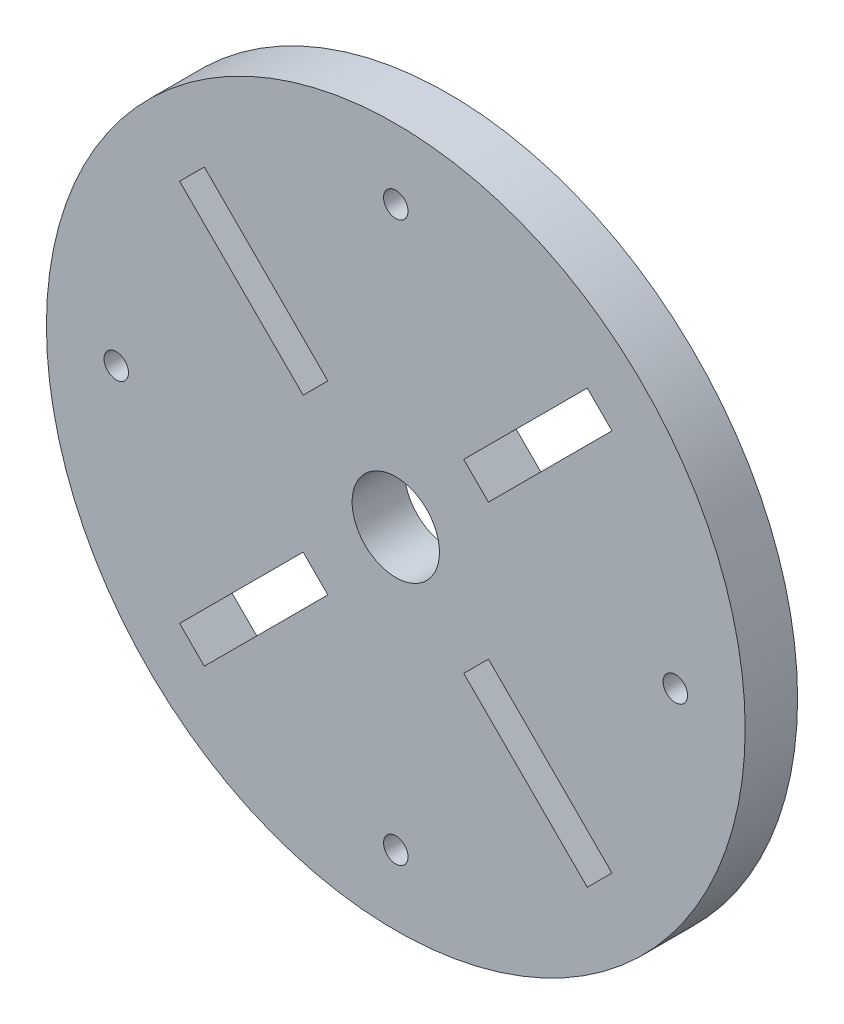
ISO-10303-21;
HEADER;
FILE_DESCRIPTION(('STEP AP214'),'2;1');
FILE_NAME('part.step','',(''),(''),'','','');
FILE_SCHEMA(('AUTOMOTIVE_DESIGN { 1 0 10303 214 1 1 1 1 }'));
ENDSEC;
DATA;
#1=APPLICATION_CONTEXT('core data for automotive mechanical design processes');
#2=APPLICATION_PROTOCOL_DEFINITION('international standard','automotive_design',2000,#1);
#3=PRODUCT_CONTEXT('',#1,'mechanical');
#4=PRODUCT('Part','Part','',(#3));
#5=PRODUCT_RELATED_PRODUCT_CATEGORY('part','',(#4));
#6=PRODUCT_DEFINITION_FORMATION('','',#4);
#7=PRODUCT_DEFINITION_CONTEXT('part definition',#1,'design');
#8=PRODUCT_DEFINITION('design','',#6,#7);
#9=PRODUCT_DEFINITION_SHAPE('','',#8);
#10=(LENGTH_UNIT() NAMED_UNIT(*) SI_UNIT(.MILLI.,.METRE.));
#11=(NAMED_UNIT(*) PLANE_ANGLE_UNIT() SI_UNIT($,.RADIAN.));
#12=(NAMED_UNIT(*) SI_UNIT($,.STERADIAN.) SOLID_ANGLE_UNIT());
#13=UNCERTAINTY_MEASURE_WITH_UNIT(LENGTH_MEASURE(1.E-05),#10,'distance_accuracy_value','');
#14=(GEOMETRIC_REPRESENTATION_CONTEXT(3) GLOBAL_UNCERTAINTY_ASSIGNED_CONTEXT((#13)) GLOBAL_UNIT_ASSIGNED_CONTEXT((#10,
#11,#12)) REPRESENTATION_CONTEXT('',''));
#15=CARTESIAN_POINT('',(0.,0.,0.));
#16=DIRECTION('',(0.,0.,1.));
#17=DIRECTION('',(1.,0.,0.));
#18=AXIS2_PLACEMENT_3D('',#15,#16,#17);
#19=CARTESIAN_POINT('',(0.,0.,3.));
#20=DIRECTION('',(0.,0.,-1.));
#21=DIRECTION('',(-1.,0.,0.));
#22=AXIS2_PLACEMENT_3D('',#19,#20,#21);
#23=CYLINDRICAL_SURFACE('',#22,20.);
#24=CARTESIAN_POINT('',(0.,0.,3.));
#25=DIRECTION('',(0.,0.,1.));
#26=DIRECTION('',(1.,0.,0.));
#27=AXIS2_PLACEMENT_3D('',#24,#25,#26);
#28=CIRCLE('',#27,20.);
#29=CARTESIAN_POINT('',(20.,0.,3.));
#30=VERTEX_POINT('',#29);
#31=EDGE_CURVE('E11',#30,#30,#28,.T.);
#32=ORIENTED_EDGE('',*,*,#31,.F.);
#33=EDGE_LOOP('',(#32));
#34=FACE_BOUND('',#33,.T.);
#35=CARTESIAN_POINT('',(0.,0.,0.));
#36=DIRECTION('',(0.,0.,1.));
#37=DIRECTION('',(1.,0.,0.));
#38=AXIS2_PLACEMENT_3D('',#35,#36,#37);
#39=CIRCLE('',#38,20.);
#40=CARTESIAN_POINT('',(20.,0.,0.));
#41=VERTEX_POINT('',#40);
#42=EDGE_CURVE('E36',#41,#41,#39,.T.);
#43=ORIENTED_EDGE('',*,*,#42,.T.);
#44=EDGE_LOOP('',(#43));
#45=FACE_BOUND('',#44,.T.);
#46=ADVANCED_FACE('F33',(#34,#45),#23,.T.);
#47=CARTESIAN_POINT('',(0.,0.,3.));
#48=DIRECTION('',(0.,0.,1.));
#49=DIRECTION('',(1.,0.,0.));
#50=AXIS2_PLACEMENT_3D('',#47,#48,#49);
#51=PLANE('',#50);
#52=DIRECTION('',(-0.70710678118655,-0.707106781186545,0.));
#53=VECTOR('',#52,1.);
#54=CARTESIAN_POINT('',(4.59619407771255,-4.59619407771246,3.));
#55=LINE('',#54,#53);
#56=CARTESIAN_POINT('',(5.3033008588991,-3.88908729652591,3.));
#57=VERTEX_POINT('',#56);
#58=CARTESIAN_POINT('',(3.889087296526,-5.303300858899,3.));
#59=VERTEX_POINT('',#58);
#60=EDGE_CURVE('E47',#57,#59,#55,.T.);
#61=ORIENTED_EDGE('',*,*,#60,.F.);
#62=DIRECTION('',(-0.707106781186545,0.70710678118655,0.));
#63=VECTOR('',#62,1.);
#64=CARTESIAN_POINT('',(5.3033008588991,-3.88908729652591,3.));
#65=LINE('',#64,#63);
#66=CARTESIAN_POINT('',(12.3743686707646,-10.9601551083914,3.));
#67=VERTEX_POINT('',#66);
#68=EDGE_CURVE('E177',#67,#57,#65,.T.);
#69=ORIENTED_EDGE('',*,*,#68,.F.);
#70=DIRECTION('',(0.70710678118655,0.707106781186545,0.));
#71=VECTOR('',#70,1.);
#72=CARTESIAN_POINT('',(12.3743686707646,-10.9601551083914,3.));
#73=LINE('',#72,#71);
#74=CARTESIAN_POINT('',(10.9601551083915,-12.3743686707645,3.));
#75=VERTEX_POINT('',#74);
#76=EDGE_CURVE('E169',#75,#67,#73,.T.);
#77=ORIENTED_EDGE('',*,*,#76,.F.);
#78=DIRECTION('',(0.707106781186545,-0.70710678118655,0.));
#79=VECTOR('',#78,1.);
#80=CARTESIAN_POINT('',(10.9601551083915,-12.3743686707645,3.));
#81=LINE('',#80,#79);
#82=EDGE_CURVE('E167',#59,#75,#81,.T.);
#83=ORIENTED_EDGE('',*,*,#82,.F.);
#84=EDGE_LOOP('',(#61,#69,#77,#83));
#85=FACE_BOUND('',#84,.T.);
#86=DIRECTION('',(-0.707106781186547,0.707106781186547,0.));
#87=VECTOR('',#86,1.);
#88=CARTESIAN_POINT('',(-4.59619407771244,-4.59619407771257,3.));
#89=LINE('',#88,#87);
#90=CARTESIAN_POINT('',(-3.88908729652589,-5.30330085889912,3.));
#91=VERTEX_POINT('',#90);
#92=CARTESIAN_POINT('',(-5.30330085889899,-3.88908729652602,3.));
#93=VERTEX_POINT('',#92);
#94=EDGE_CURVE('E55',#91,#93,#89,.T.);
#95=ORIENTED_EDGE('',*,*,#94,.F.);
#96=DIRECTION('',(0.707106781186548,0.707106781186547,0.));
#97=VECTOR('',#96,1.);
#98=CARTESIAN_POINT('',(-3.88908729652589,-5.30330085889912,3.));
#99=LINE('',#98,#97);
#100=CARTESIAN_POINT('',(-10.9601551083914,-12.3743686707646,3.));
#101=VERTEX_POINT('',#100);
#102=EDGE_CURVE('E200',#101,#91,#99,.T.);
#103=ORIENTED_EDGE('',*,*,#102,.F.);
#104=DIRECTION('',(0.707106781186547,-0.707106781186547,0.));
#105=VECTOR('',#104,1.);
#106=CARTESIAN_POINT('',(-10.9601551083914,-12.3743686707646,3.));
#107=LINE('',#106,#105);
#108=CARTESIAN_POINT('',(-12.3743686707645,-10.9601551083915,3.));
#109=VERTEX_POINT('',#108);
#110=EDGE_CURVE('E197',#109,#101,#107,.T.);
#111=ORIENTED_EDGE('',*,*,#110,.F.);
#112=DIRECTION('',(-0.707106781186547,-0.707106781186548,0.));
#113=VECTOR('',#112,1.);
#114=CARTESIAN_POINT('',(-12.3743686707645,-10.9601551083915,3.));
#115=LINE('',#114,#113);
#116=EDGE_CURVE('E194',#93,#109,#115,.T.);
#117=ORIENTED_EDGE('',*,*,#116,.F.);
#118=EDGE_LOOP('',(#95,#103,#111,#117));
#119=FACE_BOUND('',#118,.T.);
#120=DIRECTION('',(0.707106781186555,0.70710678118654,0.));
#121=VECTOR('',#120,1.);
#122=CARTESIAN_POINT('',(-4.59619407771252,4.59619407771249,3.));
#123=LINE('',#122,#121);
#124=CARTESIAN_POINT('',(-5.30330085889908,3.88908729652595,3.));
#125=VERTEX_POINT('',#124);
#126=CARTESIAN_POINT('',(-3.88908729652596,5.30330085889903,3.));
#127=VERTEX_POINT('',#126);
#128=EDGE_CURVE('E232',#125,#127,#123,.T.);
#129=ORIENTED_EDGE('',*,*,#128,.F.);
#130=DIRECTION('',(0.70710678118654,-0.707106781186555,0.));
#131=VECTOR('',#130,1.);
#132=CARTESIAN_POINT('',(-5.30330085889908,3.88908729652595,3.));
#133=LINE('',#132,#131);
#134=CARTESIAN_POINT('',(-12.3743686707645,10.9601551083915,3.));
#135=VERTEX_POINT('',#134);
#136=EDGE_CURVE('E229',#135,#125,#133,.T.);
#137=ORIENTED_EDGE('',*,*,#136,.F.);
#138=DIRECTION('',(-0.707106781186555,-0.70710678118654,0.));
#139=VECTOR('',#138,1.);
#140=CARTESIAN_POINT('',(-12.3743686707645,10.9601551083915,3.));
#141=LINE('',#140,#139);
#142=CARTESIAN_POINT('',(-10.9601551083914,12.3743686707646,3.));
#143=VERTEX_POINT('',#142);
#144=EDGE_CURVE('E226',#143,#135,#141,.T.);
#145=ORIENTED_EDGE('',*,*,#144,.F.);
#146=DIRECTION('',(-0.70710678118654,0.707106781186555,0.));
#147=VECTOR('',#146,1.);
#148=CARTESIAN_POINT('',(-10.9601551083914,12.3743686707646,3.));
#149=LINE('',#148,#147);
#150=EDGE_CURVE('E223',#127,#143,#149,.T.);
#151=ORIENTED_EDGE('',*,*,#150,.F.);
#152=EDGE_LOOP('',(#129,#137,#145,#151));
#153=FACE_BOUND('',#152,.T.);
#154=DIRECTION('',(0.707106781186547,-0.707106781186547,0.));
#155=VECTOR('',#154,1.);
#156=CARTESIAN_POINT('',(4.59619407771244,4.59619407771257,3.));
#157=LINE('',#156,#155);
#158=CARTESIAN_POINT('',(3.88908729652589,5.30330085889912,3.));
#159=VERTEX_POINT('',#158);
#160=CARTESIAN_POINT('',(5.30330085889899,3.88908729652602,3.));
#161=VERTEX_POINT('',#160);
#162=EDGE_CURVE('E261',#159,#161,#157,.T.);
#163=ORIENTED_EDGE('',*,*,#162,.F.);
#164=DIRECTION('',(-0.707106781186548,-0.707106781186547,0.));
#165=VECTOR('',#164,1.);
#166=CARTESIAN_POINT('',(3.88908729652589,5.30330085889912,3.));
#167=LINE('',#166,#165);
#168=CARTESIAN_POINT('',(10.9601551083914,12.3743686707646,3.));
#169=VERTEX_POINT('',#168);
#170=EDGE_CURVE('E258',#169,#159,#167,.T.);
#171=ORIENTED_EDGE('',*,*,#170,.F.);
#172=DIRECTION('',(-0.707106781186547,0.707106781186547,0.));
#173=VECTOR('',#172,1.);
#174=CARTESIAN_POINT('',(10.9601551083914,12.3743686707646,3.));
#175=LINE('',#174,#173);
#176=CARTESIAN_POINT('',(12.3743686707645,10.9601551083915,3.));
#177=VERTEX_POINT('',#176);
#178=EDGE_CURVE('E255',#177,#169,#175,.T.);
#179=ORIENTED_EDGE('',*,*,#178,.F.);
#180=DIRECTION('',(0.707106781186547,0.707106781186548,0.));
#181=VECTOR('',#180,1.);
#182=CARTESIAN_POINT('',(12.3743686707645,10.9601551083915,3.));
#183=LINE('',#182,#181);
#184=EDGE_CURVE('E252',#161,#177,#183,.T.);
#185=ORIENTED_EDGE('',*,*,#184,.F.);
#186=EDGE_LOOP('',(#163,#171,#179,#185));
#187=FACE_BOUND('',#186,.T.);
#188=CARTESIAN_POINT('',(0.,0.,3.));
#189=DIRECTION('',(0.,0.,1.));
#190=DIRECTION('',(1.,0.,0.));
#191=AXIS2_PLACEMENT_3D('',#188,#189,#190);
#192=CIRCLE('',#191,2.5);
#193=CARTESIAN_POINT('',(2.5,0.,3.));
#194=VERTEX_POINT('',#193);
#195=EDGE_CURVE('E275',#194,#194,#192,.T.);
#196=ORIENTED_EDGE('',*,*,#195,.F.);
#197=EDGE_LOOP('',(#196));
#198=FACE_BOUND('',#197,.T.);
#199=CARTESIAN_POINT('',(-16.,0.,3.));
#200=DIRECTION('',(0.,0.,1.));
#201=DIRECTION('',(0.,1.,0.));
#202=AXIS2_PLACEMENT_3D('',#199,#200,#201);
#203=CIRCLE('',#202,0.7);
#204=CARTESIAN_POINT('',(-16.,0.699999999999944,3.));
#205=VERTEX_POINT('',#204);
#206=EDGE_CURVE('E282',#205,#205,#203,.T.);
#207=ORIENTED_EDGE('',*,*,#206,.F.);
#208=EDGE_LOOP('',(#207));
#209=FACE_BOUND('',#208,.T.);
#210=CARTESIAN_POINT('',(0.,-16.,3.));
#211=DIRECTION('',(0.,0.,1.));
#212=DIRECTION('',(-1.,0.,0.));
#213=AXIS2_PLACEMENT_3D('',#210,#211,#212);
#214=CIRCLE('',#213,0.7);
#215=CARTESIAN_POINT('',(-0.7,-16.,3.));
#216=VERTEX_POINT('',#215);
#217=EDGE_CURVE('E290',#216,#216,#214,.T.);
#218=ORIENTED_EDGE('',*,*,#217,.F.);
#219=EDGE_LOOP('',(#218));
#220=FACE_BOUND('',#219,.T.);
#221=CARTESIAN_POINT('',(16.,1.6759110426447E-13,3.));
#222=DIRECTION('',(0.,0.,1.));
#223=DIRECTION('',(0.,-1.,0.));
#224=AXIS2_PLACEMENT_3D('',#221,#222,#223);
#225=CIRCLE('',#224,0.7);
#226=CARTESIAN_POINT('',(16.,-0.699999999999832,3.));
#227=VERTEX_POINT('',#226);
#228=EDGE_CURVE('E279',#227,#227,#225,.T.);
#229=ORIENTED_EDGE('',*,*,#228,.F.);
#230=EDGE_LOOP('',(#229));
#231=FACE_BOUND('',#230,.T.);
#232=CARTESIAN_POINT('',(0.,16.,3.));
#233=DIRECTION('',(0.,0.,1.));
#234=DIRECTION('',(1.,0.,0.));
#235=AXIS2_PLACEMENT_3D('',#232,#233,#234);
#236=CIRCLE('',#235,0.7);
#237=CARTESIAN_POINT('',(0.7,16.,3.));
#238=VERTEX_POINT('',#237);
#239=EDGE_CURVE('E289',#238,#238,#236,.T.);
#240=ORIENTED_EDGE('',*,*,#239,.F.);
#241=EDGE_LOOP('',(#240));
#242=FACE_BOUND('',#241,.T.);
#243=ORIENTED_EDGE('',*,*,#31,.T.);
#244=EDGE_LOOP('',(#243));
#245=FACE_BOUND('',#244,.T.);
#246=ADVANCED_FACE('F312',(#85,#119,#153,#187,#198,#209,#220,#231,#242,#245),#51,.T.);
#247=CARTESIAN_POINT('',(0.,0.,0.));
#248=DIRECTION('',(0.,0.,1.));
#249=DIRECTION('',(1.,0.,0.));
#250=AXIS2_PLACEMENT_3D('',#247,#248,#249);
#251=PLANE('',#250);
#252=DIRECTION('',(0.707106781186545,-0.70710678118655,0.));
#253=VECTOR('',#252,1.);
#254=CARTESIAN_POINT('',(5.3033008588991,-3.88908729652591,0.));
#255=LINE('',#254,#253);
#256=CARTESIAN_POINT('',(5.3033008588991,-3.88908729652591,0.));
#257=VERTEX_POINT('',#256);
#258=CARTESIAN_POINT('',(12.3743686707646,-10.9601551083914,0.));
#259=VERTEX_POINT('',#258);
#260=EDGE_CURVE('E166',#257,#259,#255,.T.);
#261=ORIENTED_EDGE('',*,*,#260,.F.);
#262=DIRECTION('',(0.70710678118655,0.707106781186545,0.));
#263=VECTOR('',#262,1.);
#264=CARTESIAN_POINT('',(4.59619407771255,-4.59619407771246,0.));
#265=LINE('',#264,#263);
#266=CARTESIAN_POINT('',(3.889087296526,-5.303300858899,0.));
#267=VERTEX_POINT('',#266);
#268=EDGE_CURVE('E147',#267,#257,#265,.T.);
#269=ORIENTED_EDGE('',*,*,#268,.F.);
#270=DIRECTION('',(-0.707106781186545,0.70710678118655,0.));
#271=VECTOR('',#270,1.);
#272=CARTESIAN_POINT('',(10.9601551083915,-12.3743686707645,0.));
#273=LINE('',#272,#271);
#274=CARTESIAN_POINT('',(10.9601551083915,-12.3743686707645,0.));
#275=VERTEX_POINT('',#274);
#276=EDGE_CURVE('E156',#275,#267,#273,.T.);
#277=ORIENTED_EDGE('',*,*,#276,.F.);
#278=DIRECTION('',(-0.70710678118655,-0.707106781186545,0.));
#279=VECTOR('',#278,1.);
#280=CARTESIAN_POINT('',(12.3743686707646,-10.9601551083914,0.));
#281=LINE('',#280,#279);
#282=EDGE_CURVE('E171',#259,#275,#281,.T.);
#283=ORIENTED_EDGE('',*,*,#282,.F.);
#284=EDGE_LOOP('',(#261,#269,#277,#283));
#285=FACE_BOUND('',#284,.T.);
#286=DIRECTION('',(-0.707106781186548,-0.707106781186547,0.));
#287=VECTOR('',#286,1.);
#288=CARTESIAN_POINT('',(-3.88908729652589,-5.30330085889912,0.));
#289=LINE('',#288,#287);
#290=CARTESIAN_POINT('',(-3.88908729652589,-5.30330085889912,0.));
#291=VERTEX_POINT('',#290);
#292=CARTESIAN_POINT('',(-10.9601551083914,-12.3743686707646,0.));
#293=VERTEX_POINT('',#292);
#294=EDGE_CURVE('E187',#291,#293,#289,.T.);
#295=ORIENTED_EDGE('',*,*,#294,.F.);
#296=DIRECTION('',(0.707106781186548,-0.707106781186548,0.));
#297=VECTOR('',#296,1.);
#298=CARTESIAN_POINT('',(-4.59619407771244,-4.59619407771257,0.));
#299=LINE('',#298,#297);
#300=CARTESIAN_POINT('',(-5.30330085889899,-3.88908729652602,0.));
#301=VERTEX_POINT('',#300);
#302=EDGE_CURVE('E191',#301,#291,#299,.T.);
#303=ORIENTED_EDGE('',*,*,#302,.F.);
#304=DIRECTION('',(0.707106781186547,0.707106781186548,0.));
#305=VECTOR('',#304,1.);
#306=CARTESIAN_POINT('',(-12.3743686707645,-10.9601551083915,0.));
#307=LINE('',#306,#305);
#308=CARTESIAN_POINT('',(-12.3743686707645,-10.9601551083915,0.));
#309=VERTEX_POINT('',#308);
#310=EDGE_CURVE('E207',#309,#301,#307,.T.);
#311=ORIENTED_EDGE('',*,*,#310,.F.);
#312=DIRECTION('',(-0.707106781186548,0.707106781186548,0.));
#313=VECTOR('',#312,1.);
#314=CARTESIAN_POINT('',(-10.9601551083914,-12.3743686707646,0.));
#315=LINE('',#314,#313);
#316=EDGE_CURVE('E185',#293,#309,#315,.T.);
#317=ORIENTED_EDGE('',*,*,#316,.F.);
#318=EDGE_LOOP('',(#295,#303,#311,#317));
#319=FACE_BOUND('',#318,.T.);
#320=DIRECTION('',(-0.70710678118654,0.707106781186555,0.));
#321=VECTOR('',#320,1.);
#322=CARTESIAN_POINT('',(-5.30330085889908,3.88908729652595,0.));
#323=LINE('',#322,#321);
#324=CARTESIAN_POINT('',(-5.30330085889908,3.88908729652595,0.));
#325=VERTEX_POINT('',#324);
#326=CARTESIAN_POINT('',(-12.3743686707645,10.9601551083915,0.));
#327=VERTEX_POINT('',#326);
#328=EDGE_CURVE('E217',#325,#327,#323,.T.);
#329=ORIENTED_EDGE('',*,*,#328,.F.);
#330=DIRECTION('',(-0.707106781186555,-0.70710678118654,0.));
#331=VECTOR('',#330,1.);
#332=CARTESIAN_POINT('',(-4.59619407771252,4.59619407771249,0.));
#333=LINE('',#332,#331);
#334=CARTESIAN_POINT('',(-3.88908729652597,5.30330085889903,0.));
#335=VERTEX_POINT('',#334);
#336=EDGE_CURVE('E220',#335,#325,#333,.T.);
#337=ORIENTED_EDGE('',*,*,#336,.F.);
#338=DIRECTION('',(0.70710678118654,-0.707106781186555,0.));
#339=VECTOR('',#338,1.);
#340=CARTESIAN_POINT('',(-10.9601551083914,12.3743686707646,0.));
#341=LINE('',#340,#339);
#342=CARTESIAN_POINT('',(-10.9601551083914,12.3743686707646,0.));
#343=VERTEX_POINT('',#342);
#344=EDGE_CURVE('E188',#343,#335,#341,.T.);
#345=ORIENTED_EDGE('',*,*,#344,.F.);
#346=DIRECTION('',(0.707106781186555,0.70710678118654,0.));
#347=VECTOR('',#346,1.);
#348=CARTESIAN_POINT('',(-12.3743686707645,10.9601551083915,0.));
#349=LINE('',#348,#347);
#350=EDGE_CURVE('E215',#327,#343,#349,.T.);
#351=ORIENTED_EDGE('',*,*,#350,.F.);
#352=EDGE_LOOP('',(#329,#337,#345,#351));
#353=FACE_BOUND('',#352,.T.);
#354=DIRECTION('',(0.707106781186548,0.707106781186547,0.));
#355=VECTOR('',#354,1.);
#356=CARTESIAN_POINT('',(3.88908729652589,5.30330085889912,0.));
#357=LINE('',#356,#355);
#358=CARTESIAN_POINT('',(3.88908729652589,5.30330085889912,0.));
#359=VERTEX_POINT('',#358);
#360=CARTESIAN_POINT('',(10.9601551083914,12.3743686707646,0.));
#361=VERTEX_POINT('',#360);
#362=EDGE_CURVE('E246',#359,#361,#357,.T.);
#363=ORIENTED_EDGE('',*,*,#362,.F.);
#364=DIRECTION('',(-0.707106781186548,0.707106781186548,0.));
#365=VECTOR('',#364,1.);
#366=CARTESIAN_POINT('',(4.59619407771244,4.59619407771257,0.));
#367=LINE('',#366,#365);
#368=CARTESIAN_POINT('',(5.30330085889899,3.88908729652602,0.));
#369=VERTEX_POINT('',#368);
#370=EDGE_CURVE('E249',#369,#359,#367,.T.);
#371=ORIENTED_EDGE('',*,*,#370,.F.);
#372=DIRECTION('',(-0.707106781186547,-0.707106781186548,0.));
#373=VECTOR('',#372,1.);
#374=CARTESIAN_POINT('',(12.3743686707645,10.9601551083915,0.));
#375=LINE('',#374,#373);
#376=CARTESIAN_POINT('',(12.3743686707645,10.9601551083915,0.));
#377=VERTEX_POINT('',#376);
#378=EDGE_CURVE('E266',#377,#369,#375,.T.);
#379=ORIENTED_EDGE('',*,*,#378,.F.);
#380=DIRECTION('',(0.707106781186548,-0.707106781186548,0.));
#381=VECTOR('',#380,1.);
#382=CARTESIAN_POINT('',(10.9601551083914,12.3743686707646,0.));
#383=LINE('',#382,#381);
#384=EDGE_CURVE('E160',#361,#377,#383,.T.);
#385=ORIENTED_EDGE('',*,*,#384,.F.);
#386=EDGE_LOOP('',(#363,#371,#379,#385));
#387=FACE_BOUND('',#386,.T.);
#388=CARTESIAN_POINT('',(0.,0.,0.));
#389=DIRECTION('',(0.,0.,1.));
#390=DIRECTION('',(1.,0.,0.));
#391=AXIS2_PLACEMENT_3D('',#388,#389,#390);
#392=CIRCLE('',#391,2.5);
#393=CARTESIAN_POINT('',(2.5,0.,0.));
#394=VERTEX_POINT('',#393);
#395=EDGE_CURVE('E276',#394,#394,#392,.T.);
#396=ORIENTED_EDGE('',*,*,#395,.T.);
#397=EDGE_LOOP('',(#396));
#398=FACE_BOUND('',#397,.T.);
#399=CARTESIAN_POINT('',(-16.,0.,0.));
#400=DIRECTION('',(0.,0.,1.));
#401=DIRECTION('',(1.,0.,0.));
#402=AXIS2_PLACEMENT_3D('',#399,#400,#401);
#403=CIRCLE('',#402,0.7);
#404=CARTESIAN_POINT('',(-15.3,0.,0.));
#405=VERTEX_POINT('',#404);
#406=EDGE_CURVE('E285',#405,#405,#403,.F.);
#407=ORIENTED_EDGE('',*,*,#406,.F.);
#408=EDGE_LOOP('',(#407));
#409=FACE_BOUND('',#408,.T.);
#410=CARTESIAN_POINT('',(0.,-16.,0.));
#411=DIRECTION('',(0.,0.,1.));
#412=DIRECTION('',(1.,0.,0.));
#413=AXIS2_PLACEMENT_3D('',#410,#411,#412);
#414=CIRCLE('',#413,0.7);
#415=CARTESIAN_POINT('',(0.7,-16.,0.));
#416=VERTEX_POINT('',#415);
#417=EDGE_CURVE('E286',#416,#416,#414,.F.);
#418=ORIENTED_EDGE('',*,*,#417,.F.);
#419=EDGE_LOOP('',(#418));
#420=FACE_BOUND('',#419,.T.);
#421=CARTESIAN_POINT('',(16.,1.6759110426447E-13,0.));
#422=DIRECTION('',(0.,0.,1.));
#423=DIRECTION('',(1.,0.,0.));
#424=AXIS2_PLACEMENT_3D('',#421,#422,#423);
#425=CIRCLE('',#424,0.7);
#426=CARTESIAN_POINT('',(16.7,1.6759110426447E-13,0.));
#427=VERTEX_POINT('',#426);
#428=EDGE_CURVE('E293',#427,#427,#425,.F.);
#429=ORIENTED_EDGE('',*,*,#428,.F.);
#430=EDGE_LOOP('',(#429));
#431=FACE_BOUND('',#430,.T.);
#432=CARTESIAN_POINT('',(0.,16.,0.));
#433=DIRECTION('',(0.,0.,1.));
#434=DIRECTION('',(1.,0.,0.));
#435=AXIS2_PLACEMENT_3D('',#432,#433,#434);
#436=CIRCLE('',#435,0.7);
#437=CARTESIAN_POINT('',(0.7,16.,0.));
#438=VERTEX_POINT('',#437);
#439=EDGE_CURVE('E302',#438,#438,#436,.F.);
#440=ORIENTED_EDGE('',*,*,#439,.F.);
#441=EDGE_LOOP('',(#440));
#442=FACE_BOUND('',#441,.T.);
#443=ORIENTED_EDGE('',*,*,#42,.F.);
#444=EDGE_LOOP('',(#443));
#445=FACE_BOUND('',#444,.T.);
#446=ADVANCED_FACE('F163',(#285,#319,#353,#387,#398,#409,#420,#431,#442,#445),#251,.F.);
#447=CARTESIAN_POINT('',(0.,16.,-0.00100000000000013));
#448=DIRECTION('',(0.,0.,1.));
#449=DIRECTION('',(1.,0.,0.));
#450=AXIS2_PLACEMENT_3D('',#447,#448,#449);
#451=CYLINDRICAL_SURFACE('',#450,0.7);
#452=ORIENTED_EDGE('',*,*,#239,.T.);
#453=EDGE_LOOP('',(#452));
#454=FACE_BOUND('',#453,.T.);
#455=ORIENTED_EDGE('',*,*,#439,.T.);
#456=EDGE_LOOP('',(#455));
#457=FACE_BOUND('',#456,.T.);
#458=ADVANCED_FACE('F311',(#454,#457),#451,.F.);
#459=CARTESIAN_POINT('',(16.,1.6759110426447E-13,-0.00100000000000013));
#460=DIRECTION('',(0.,0.,1.));
#461=DIRECTION('',(1.,0.,0.));
#462=AXIS2_PLACEMENT_3D('',#459,#460,#461);
#463=CYLINDRICAL_SURFACE('',#462,0.7);
#464=ORIENTED_EDGE('',*,*,#228,.T.);
#465=EDGE_LOOP('',(#464));
#466=FACE_BOUND('',#465,.T.);
#467=ORIENTED_EDGE('',*,*,#428,.T.);
#468=EDGE_LOOP('',(#467));
#469=FACE_BOUND('',#468,.T.);
#470=ADVANCED_FACE('F317',(#466,#469),#463,.F.);
#471=CARTESIAN_POINT('',(0.,-16.,-0.00100000000000013));
#472=DIRECTION('',(0.,0.,1.));
#473=DIRECTION('',(1.,0.,0.));
#474=AXIS2_PLACEMENT_3D('',#471,#472,#473);
#475=CYLINDRICAL_SURFACE('',#474,0.7);
#476=ORIENTED_EDGE('',*,*,#217,.T.);
#477=EDGE_LOOP('',(#476));
#478=FACE_BOUND('',#477,.T.);
#479=ORIENTED_EDGE('',*,*,#417,.T.);
#480=EDGE_LOOP('',(#479));
#481=FACE_BOUND('',#480,.T.);
#482=ADVANCED_FACE('F488',(#478,#481),#475,.F.);
#483=CARTESIAN_POINT('',(-16.,0.,-0.00100000000000013));
#484=DIRECTION('',(0.,0.,1.));
#485=DIRECTION('',(1.,0.,0.));
#486=AXIS2_PLACEMENT_3D('',#483,#484,#485);
#487=CYLINDRICAL_SURFACE('',#486,0.7);
#488=ORIENTED_EDGE('',*,*,#206,.T.);
#489=EDGE_LOOP('',(#488));
#490=FACE_BOUND('',#489,.T.);
#491=ORIENTED_EDGE('',*,*,#406,.T.);
#492=EDGE_LOOP('',(#491));
#493=FACE_BOUND('',#492,.T.);
#494=ADVANCED_FACE('F484',(#490,#493),#487,.F.);
#495=CARTESIAN_POINT('',(0.,0.,0.));
#496=DIRECTION('',(0.,0.,1.));
#497=DIRECTION('',(1.,0.,0.));
#498=AXIS2_PLACEMENT_3D('',#495,#496,#497);
#499=CYLINDRICAL_SURFACE('',#498,2.5);
#500=ORIENTED_EDGE('',*,*,#395,.F.);
#501=EDGE_LOOP('',(#500));
#502=FACE_BOUND('',#501,.T.);
#503=ORIENTED_EDGE('',*,*,#195,.T.);
#504=EDGE_LOOP('',(#503));
#505=FACE_BOUND('',#504,.T.);
#506=ADVANCED_FACE('F471',(#502,#505),#499,.F.);
#507=CARTESIAN_POINT('',(4.59619407771244,4.59619407771257,-0.00100000000000013));
#508=DIRECTION('',(-0.707106781186547,-0.707106781186547,0.));
#509=DIRECTION('',(0.707106781186548,-0.707106781186548,0.));
#510=AXIS2_PLACEMENT_3D('',#507,#508,#509);
#511=PLANE('',#510);
#512=ORIENTED_EDGE('',*,*,#370,.T.);
#513=DIRECTION('',(0.,0.,1.));
#514=VECTOR('',#513,1.);
#515=CARTESIAN_POINT('',(3.88908729652589,5.30330085889912,-0.00100000000000013));
#516=LINE('',#515,#514);
#517=EDGE_CURVE('E264',#359,#159,#516,.T.);
#518=ORIENTED_EDGE('',*,*,#517,.T.);
#519=ORIENTED_EDGE('',*,*,#162,.T.);
#520=DIRECTION('',(0.,0.,1.));
#521=VECTOR('',#520,1.);
#522=CARTESIAN_POINT('',(5.30330085889899,3.88908729652602,-0.00100000000000013));
#523=LINE('',#522,#521);
#524=EDGE_CURVE('E263',#369,#161,#523,.T.);
#525=ORIENTED_EDGE('',*,*,#524,.F.);
#526=EDGE_LOOP('',(#512,#518,#519,#525));
#527=FACE_BOUND('',#526,.T.);
#528=ADVANCED_FACE('F467',(#527),#511,.F.);
#529=CARTESIAN_POINT('',(3.88908729652589,5.30330085889912,-0.00100000000000013));
#530=DIRECTION('',(-0.707106781186547,0.707106781186548,0.));
#531=DIRECTION('',(-0.707106781186548,-0.707106781186547,0.));
#532=AXIS2_PLACEMENT_3D('',#529,#530,#531);
#533=PLANE('',#532);
#534=ORIENTED_EDGE('',*,*,#362,.T.);
#535=DIRECTION('',(0.,0.,1.));
#536=VECTOR('',#535,1.);
#537=CARTESIAN_POINT('',(10.9601551083914,12.3743686707646,-0.00100000000000013));
#538=LINE('',#537,#536);
#539=EDGE_CURVE('E267',#361,#169,#538,.T.);
#540=ORIENTED_EDGE('',*,*,#539,.T.);
#541=ORIENTED_EDGE('',*,*,#170,.T.);
#542=ORIENTED_EDGE('',*,*,#517,.F.);
#543=EDGE_LOOP('',(#534,#540,#541,#542));
#544=FACE_BOUND('',#543,.T.);
#545=ADVANCED_FACE('F470',(#544),#533,.F.);
#546=CARTESIAN_POINT('',(10.9601551083914,12.3743686707646,-0.00100000000000013));
#547=DIRECTION('',(0.707106781186547,0.707106781186547,0.));
#548=DIRECTION('',(-0.707106781186548,0.707106781186548,0.));
#549=AXIS2_PLACEMENT_3D('',#546,#547,#548);
#550=PLANE('',#549);
#551=ORIENTED_EDGE('',*,*,#384,.T.);
#552=DIRECTION('',(0.,0.,1.));
#553=VECTOR('',#552,1.);
#554=CARTESIAN_POINT('',(12.3743686707645,10.9601551083915,-0.00100000000000013));
#555=LINE('',#554,#553);
#556=EDGE_CURVE('E269',#377,#177,#555,.T.);
#557=ORIENTED_EDGE('',*,*,#556,.T.);
#558=ORIENTED_EDGE('',*,*,#178,.T.);
#559=ORIENTED_EDGE('',*,*,#539,.F.);
#560=EDGE_LOOP('',(#551,#557,#558,#559));
#561=FACE_BOUND('',#560,.T.);
#562=ADVANCED_FACE('F475',(#561),#550,.F.);
#563=CARTESIAN_POINT('',(12.3743686707645,10.9601551083915,-0.00100000000000013));
#564=DIRECTION('',(0.707106781186548,-0.707106781186547,0.));
#565=DIRECTION('',(0.707106781186547,0.707106781186548,0.));
#566=AXIS2_PLACEMENT_3D('',#563,#564,#565);
#567=PLANE('',#566);
#568=ORIENTED_EDGE('',*,*,#378,.T.);
#569=ORIENTED_EDGE('',*,*,#524,.T.);
#570=ORIENTED_EDGE('',*,*,#184,.T.);
#571=ORIENTED_EDGE('',*,*,#556,.F.);
#572=EDGE_LOOP('',(#568,#569,#570,#571));
#573=FACE_BOUND('',#572,.T.);
#574=ADVANCED_FACE('F339',(#573),#567,.F.);
#575=CARTESIAN_POINT('',(-4.59619407771252,4.59619407771249,-0.00100000000000013));
#576=DIRECTION('',(0.70710678118654,-0.707106781186555,0.));
#577=DIRECTION('',(0.707106781186555,0.70710678118654,0.));
#578=AXIS2_PLACEMENT_3D('',#575,#576,#577);
#579=PLANE('',#578);
#580=ORIENTED_EDGE('',*,*,#336,.T.);
#581=DIRECTION('',(0.,0.,1.));
#582=VECTOR('',#581,1.);
#583=CARTESIAN_POINT('',(-5.30330085889908,3.88908729652595,-0.00100000000000013));
#584=LINE('',#583,#582);
#585=EDGE_CURVE('E235',#325,#125,#584,.T.);
#586=ORIENTED_EDGE('',*,*,#585,.T.);
#587=ORIENTED_EDGE('',*,*,#128,.T.);
#588=DIRECTION('',(0.,0.,1.));
#589=VECTOR('',#588,1.);
#590=CARTESIAN_POINT('',(-3.88908729652596,5.30330085889903,-0.00100000000000013));
#591=LINE('',#590,#589);
#592=EDGE_CURVE('E234',#335,#127,#591,.T.);
#593=ORIENTED_EDGE('',*,*,#592,.F.);
#594=EDGE_LOOP('',(#580,#586,#587,#593));
#595=FACE_BOUND('',#594,.T.);
#596=ADVANCED_FACE('F349',(#595),#579,.F.);
#597=CARTESIAN_POINT('',(-5.30330085889908,3.88908729652595,-0.00100000000000013));
#598=DIRECTION('',(-0.707106781186555,-0.70710678118654,0.));
#599=DIRECTION('',(0.70710678118654,-0.707106781186555,0.));
#600=AXIS2_PLACEMENT_3D('',#597,#598,#599);
#601=PLANE('',#600);
#602=ORIENTED_EDGE('',*,*,#328,.T.);
#603=DIRECTION('',(0.,0.,1.));
#604=VECTOR('',#603,1.);
#605=CARTESIAN_POINT('',(-12.3743686707645,10.9601551083915,-0.00100000000000013));
#606=LINE('',#605,#604);
#607=EDGE_CURVE('E237',#327,#135,#606,.T.);
#608=ORIENTED_EDGE('',*,*,#607,.T.);
#609=ORIENTED_EDGE('',*,*,#136,.T.);
#610=ORIENTED_EDGE('',*,*,#585,.F.);
#611=EDGE_LOOP('',(#602,#608,#609,#610));
#612=FACE_BOUND('',#611,.T.);
#613=ADVANCED_FACE('F354',(#612),#601,.F.);
#614=CARTESIAN_POINT('',(-12.3743686707645,10.9601551083915,-0.00100000000000013));
#615=DIRECTION('',(-0.70710678118654,0.707106781186555,0.));
#616=DIRECTION('',(-0.707106781186555,-0.70710678118654,0.));
#617=AXIS2_PLACEMENT_3D('',#614,#615,#616);
#618=PLANE('',#617);
#619=ORIENTED_EDGE('',*,*,#350,.T.);
#620=DIRECTION('',(0.,0.,1.));
#621=VECTOR('',#620,1.);
#622=CARTESIAN_POINT('',(-10.9601551083914,12.3743686707646,-0.00100000000000013));
#623=LINE('',#622,#621);
#624=EDGE_CURVE('E239',#343,#143,#623,.T.);
#625=ORIENTED_EDGE('',*,*,#624,.T.);
#626=ORIENTED_EDGE('',*,*,#144,.T.);
#627=ORIENTED_EDGE('',*,*,#607,.F.);
#628=EDGE_LOOP('',(#619,#625,#626,#627));
#629=FACE_BOUND('',#628,.T.);
#630=ADVANCED_FACE('F365',(#629),#618,.F.);
#631=CARTESIAN_POINT('',(-10.9601551083914,12.3743686707646,-0.00100000000000013));
#632=DIRECTION('',(0.707106781186555,0.70710678118654,0.));
#633=DIRECTION('',(-0.70710678118654,0.707106781186555,0.));
#634=AXIS2_PLACEMENT_3D('',#631,#632,#633);
#635=PLANE('',#634);
#636=ORIENTED_EDGE('',*,*,#344,.T.);
#637=ORIENTED_EDGE('',*,*,#592,.T.);
#638=ORIENTED_EDGE('',*,*,#150,.T.);
#639=ORIENTED_EDGE('',*,*,#624,.F.);
#640=EDGE_LOOP('',(#636,#637,#638,#639));
#641=FACE_BOUND('',#640,.T.);
#642=ADVANCED_FACE('F375',(#641),#635,.F.);
#643=CARTESIAN_POINT('',(-4.59619407771244,-4.59619407771257,-0.00100000000000013));
#644=DIRECTION('',(0.707106781186547,0.707106781186547,0.));
#645=DIRECTION('',(-0.707106781186548,0.707106781186548,0.));
#646=AXIS2_PLACEMENT_3D('',#643,#644,#645);
#647=PLANE('',#646);
#648=ORIENTED_EDGE('',*,*,#302,.T.);
#649=DIRECTION('',(0.,0.,1.));
#650=VECTOR('',#649,1.);
#651=CARTESIAN_POINT('',(-3.88908729652589,-5.30330085889912,-0.00100000000000013));
#652=LINE('',#651,#650);
#653=EDGE_CURVE('E205',#291,#91,#652,.T.);
#654=ORIENTED_EDGE('',*,*,#653,.T.);
#655=ORIENTED_EDGE('',*,*,#94,.T.);
#656=DIRECTION('',(0.,0.,1.));
#657=VECTOR('',#656,1.);
#658=CARTESIAN_POINT('',(-5.30330085889899,-3.88908729652602,-0.00100000000000013));
#659=LINE('',#658,#657);
#660=EDGE_CURVE('E204',#301,#93,#659,.T.);
#661=ORIENTED_EDGE('',*,*,#660,.F.);
#662=EDGE_LOOP('',(#648,#654,#655,#661));
#663=FACE_BOUND('',#662,.T.);
#664=ADVANCED_FACE('F385',(#663),#647,.F.);
#665=CARTESIAN_POINT('',(-3.88908729652589,-5.30330085889912,-0.00100000000000013));
#666=DIRECTION('',(0.707106781186547,-0.707106781186548,0.));
#667=DIRECTION('',(0.707106781186548,0.707106781186547,0.));
#668=AXIS2_PLACEMENT_3D('',#665,#666,#667);
#669=PLANE('',#668);
#670=ORIENTED_EDGE('',*,*,#294,.T.);
#671=DIRECTION('',(0.,0.,1.));
#672=VECTOR('',#671,1.);
#673=CARTESIAN_POINT('',(-10.9601551083914,-12.3743686707646,-0.00100000000000013));
#674=LINE('',#673,#672);
#675=EDGE_CURVE('E208',#293,#101,#674,.T.);
#676=ORIENTED_EDGE('',*,*,#675,.T.);
#677=ORIENTED_EDGE('',*,*,#102,.T.);
#678=ORIENTED_EDGE('',*,*,#653,.F.);
#679=EDGE_LOOP('',(#670,#676,#677,#678));
#680=FACE_BOUND('',#679,.T.);
#681=ADVANCED_FACE('F396',(#680),#669,.F.);
#682=CARTESIAN_POINT('',(-10.9601551083914,-12.3743686707646,-0.00100000000000013));
#683=DIRECTION('',(-0.707106781186547,-0.707106781186547,0.));
#684=DIRECTION('',(0.707106781186548,-0.707106781186548,0.));
#685=AXIS2_PLACEMENT_3D('',#682,#683,#684);
#686=PLANE('',#685);
#687=ORIENTED_EDGE('',*,*,#316,.T.);
#688=DIRECTION('',(0.,0.,1.));
#689=VECTOR('',#688,1.);
#690=CARTESIAN_POINT('',(-12.3743686707645,-10.9601551083915,-0.00100000000000013));
#691=LINE('',#690,#689);
#692=EDGE_CURVE('E210',#309,#109,#691,.T.);
#693=ORIENTED_EDGE('',*,*,#692,.T.);
#694=ORIENTED_EDGE('',*,*,#110,.T.);
#695=ORIENTED_EDGE('',*,*,#675,.F.);
#696=EDGE_LOOP('',(#687,#693,#694,#695));
#697=FACE_BOUND('',#696,.T.);
#698=ADVANCED_FACE('F405',(#697),#686,.F.);
#699=CARTESIAN_POINT('',(-12.3743686707645,-10.9601551083915,-0.00100000000000013));
#700=DIRECTION('',(-0.707106781186548,0.707106781186547,0.));
#701=DIRECTION('',(-0.707106781186547,-0.707106781186548,0.));
#702=AXIS2_PLACEMENT_3D('',#699,#700,#701);
#703=PLANE('',#702);
#704=ORIENTED_EDGE('',*,*,#310,.T.);
#705=ORIENTED_EDGE('',*,*,#660,.T.);
#706=ORIENTED_EDGE('',*,*,#116,.T.);
#707=ORIENTED_EDGE('',*,*,#692,.F.);
#708=EDGE_LOOP('',(#704,#705,#706,#707));
#709=FACE_BOUND('',#708,.T.);
#710=ADVANCED_FACE('F415',(#709),#703,.F.);
#711=CARTESIAN_POINT('',(4.59619407771255,-4.59619407771246,-0.00100000000000013));
#712=DIRECTION('',(-0.707106781186545,0.70710678118655,0.));
#713=DIRECTION('',(-0.70710678118655,-0.707106781186545,0.));
#714=AXIS2_PLACEMENT_3D('',#711,#712,#713);
#715=PLANE('',#714);
#716=ORIENTED_EDGE('',*,*,#268,.T.);
#717=DIRECTION('',(0.,0.,1.));
#718=VECTOR('',#717,1.);
#719=CARTESIAN_POINT('',(5.3033008588991,-3.88908729652591,-0.00100000000000013));
#720=LINE('',#719,#718);
#721=EDGE_CURVE('E161',#257,#57,#720,.T.);
#722=ORIENTED_EDGE('',*,*,#721,.T.);
#723=ORIENTED_EDGE('',*,*,#60,.T.);
#724=DIRECTION('',(0.,0.,1.));
#725=VECTOR('',#724,1.);
#726=CARTESIAN_POINT('',(3.889087296526,-5.303300858899,-0.00100000000000013));
#727=LINE('',#726,#725);
#728=EDGE_CURVE('E143',#267,#59,#727,.T.);
#729=ORIENTED_EDGE('',*,*,#728,.F.);
#730=EDGE_LOOP('',(#716,#722,#723,#729));
#731=FACE_BOUND('',#730,.T.);
#732=ADVANCED_FACE('F145',(#731),#715,.F.);
#733=CARTESIAN_POINT('',(5.3033008588991,-3.88908729652591,-0.00100000000000013));
#734=DIRECTION('',(0.70710678118655,0.707106781186545,0.));
#735=DIRECTION('',(-0.707106781186545,0.70710678118655,0.));
#736=AXIS2_PLACEMENT_3D('',#733,#734,#735);
#737=PLANE('',#736);
#738=ORIENTED_EDGE('',*,*,#260,.T.);
#739=DIRECTION('',(0.,0.,1.));
#740=VECTOR('',#739,1.);
#741=CARTESIAN_POINT('',(12.3743686707646,-10.9601551083914,-0.00100000000000013));
#742=LINE('',#741,#740);
#743=EDGE_CURVE('E182',#259,#67,#742,.T.);
#744=ORIENTED_EDGE('',*,*,#743,.T.);
#745=ORIENTED_EDGE('',*,*,#68,.T.);
#746=ORIENTED_EDGE('',*,*,#721,.F.);
#747=EDGE_LOOP('',(#738,#744,#745,#746));
#748=FACE_BOUND('',#747,.T.);
#749=ADVANCED_FACE('F435',(#748),#737,.F.);
#750=CARTESIAN_POINT('',(12.3743686707646,-10.9601551083914,-0.00100000000000013));
#751=DIRECTION('',(0.707106781186545,-0.70710678118655,0.));
#752=DIRECTION('',(0.70710678118655,0.707106781186545,0.));
#753=AXIS2_PLACEMENT_3D('',#750,#751,#752);
#754=PLANE('',#753);
#755=ORIENTED_EDGE('',*,*,#282,.T.);
#756=DIRECTION('',(0.,0.,1.));
#757=VECTOR('',#756,1.);
#758=CARTESIAN_POINT('',(10.9601551083915,-12.3743686707645,-0.00100000000000013));
#759=LINE('',#758,#757);
#760=EDGE_CURVE('E152',#275,#75,#759,.T.);
#761=ORIENTED_EDGE('',*,*,#760,.T.);
#762=ORIENTED_EDGE('',*,*,#76,.T.);
#763=ORIENTED_EDGE('',*,*,#743,.F.);
#764=EDGE_LOOP('',(#755,#761,#762,#763));
#765=FACE_BOUND('',#764,.T.);
#766=ADVANCED_FACE('F444',(#765),#754,.F.);
#767=CARTESIAN_POINT('',(10.9601551083915,-12.3743686707645,-0.00100000000000013));
#768=DIRECTION('',(-0.70710678118655,-0.707106781186545,0.));
#769=DIRECTION('',(0.707106781186545,-0.70710678118655,0.));
#770=AXIS2_PLACEMENT_3D('',#767,#768,#769);
#771=PLANE('',#770);
#772=ORIENTED_EDGE('',*,*,#276,.T.);
#773=ORIENTED_EDGE('',*,*,#728,.T.);
#774=ORIENTED_EDGE('',*,*,#82,.T.);
#775=ORIENTED_EDGE('',*,*,#760,.F.);
#776=EDGE_LOOP('',(#772,#773,#774,#775));
#777=FACE_BOUND('',#776,.T.);
#778=ADVANCED_FACE('F157',(#777),#771,.F.);
#779=CLOSED_SHELL('',(#46,#246,#446,#458,#470,#482,#494,#506,#528,#545,#562,#574,#596,#613,#630,
#642,#664,#681,#698,#710,#732,#749,#766,#778));
#780=MANIFOLD_SOLID_BREP('B2',#779);
#781=ADVANCED_BREP_SHAPE_REPRESENTATION('',(#18,#780),#14);
#782=SHAPE_DEFINITION_REPRESENTATION(#9,#781);
ENDSEC;
END-ISO-10303-21;
